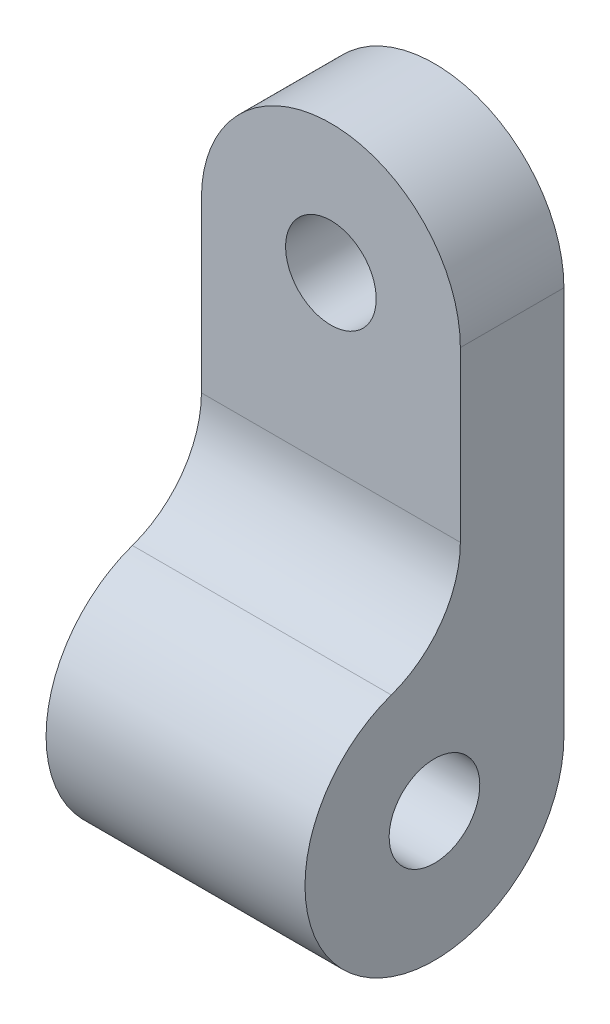
ISO-10303-21;
HEADER;
FILE_DESCRIPTION(('STEP AP214'),'2;1');
FILE_NAME('part.step','',(''),(''),'','','');
FILE_SCHEMA(('AUTOMOTIVE_DESIGN { 1 0 10303 214 1 1 1 1 }'));
ENDSEC;
DATA;
#1=APPLICATION_CONTEXT('core data for automotive mechanical design processes');
#2=APPLICATION_PROTOCOL_DEFINITION('international standard','automotive_design',2000,#1);
#3=PRODUCT_CONTEXT('',#1,'mechanical');
#4=PRODUCT('Part','Part','',(#3));
#5=PRODUCT_RELATED_PRODUCT_CATEGORY('part','',(#4));
#6=PRODUCT_DEFINITION_FORMATION('','',#4);
#7=PRODUCT_DEFINITION_CONTEXT('part definition',#1,'design');
#8=PRODUCT_DEFINITION('design','',#6,#7);
#9=PRODUCT_DEFINITION_SHAPE('','',#8);
#10=(LENGTH_UNIT() NAMED_UNIT(*) SI_UNIT(.MILLI.,.METRE.));
#11=(NAMED_UNIT(*) PLANE_ANGLE_UNIT() SI_UNIT($,.RADIAN.));
#12=(NAMED_UNIT(*) SI_UNIT($,.STERADIAN.) SOLID_ANGLE_UNIT());
#13=UNCERTAINTY_MEASURE_WITH_UNIT(LENGTH_MEASURE(1.E-05),#10,'distance_accuracy_value','');
#14=(GEOMETRIC_REPRESENTATION_CONTEXT(3) GLOBAL_UNCERTAINTY_ASSIGNED_CONTEXT((#13)) GLOBAL_UNIT_ASSIGNED_CONTEXT((#10,
#11,#12)) REPRESENTATION_CONTEXT('',''));
#15=CARTESIAN_POINT('',(0.,0.,0.));
#16=DIRECTION('',(0.,0.,1.));
#17=DIRECTION('',(1.,0.,0.));
#18=AXIS2_PLACEMENT_3D('',#15,#16,#17);
#19=CARTESIAN_POINT('',(-5.,0.,10.));
#20=DIRECTION('',(1.,0.,0.));
#21=DIRECTION('',(0.,1.,0.));
#22=AXIS2_PLACEMENT_3D('',#19,#20,#21);
#23=PLANE('',#22);
#24=CARTESIAN_POINT('',(-5.,-15.,5.));
#25=DIRECTION('',(-1.,0.,0.));
#26=DIRECTION('',(0.,-1.,0.));
#27=AXIS2_PLACEMENT_3D('',#24,#25,#26);
#28=CIRCLE('',#27,1.75);
#29=CARTESIAN_POINT('',(-5.,-16.75,5.));
#30=VERTEX_POINT('',#29);
#31=EDGE_CURVE('E233',#30,#30,#28,.T.);
#32=ORIENTED_EDGE('',*,*,#31,.F.);
#33=EDGE_LOOP('',(#32));
#34=FACE_BOUND('',#33,.T.);
#35=DIRECTION('',(0.,-1.,0.));
#36=VECTOR('',#35,1.);
#37=CARTESIAN_POINT('',(-5.,0.,0.));
#38=LINE('',#37,#36);
#39=CARTESIAN_POINT('',(-5.,0.,0.));
#40=VERTEX_POINT('',#39);
#41=CARTESIAN_POINT('',(-5.,-15.,0.));
#42=VERTEX_POINT('',#41);
#43=EDGE_CURVE('E212',#40,#42,#38,.T.);
#44=ORIENTED_EDGE('',*,*,#43,.T.);
#45=CARTESIAN_POINT('',(-5.,-15.,5.));
#46=DIRECTION('',(-1.,0.,0.));
#47=DIRECTION('',(0.,-1.,0.));
#48=AXIS2_PLACEMENT_3D('',#45,#46,#47);
#49=CIRCLE('',#48,5.);
#50=CARTESIAN_POINT('',(-5.,-10.2859547920897,6.66666666666667));
#51=VERTEX_POINT('',#50);
#52=EDGE_CURVE('E200',#42,#51,#49,.T.);
#53=ORIENTED_EDGE('',*,*,#52,.T.);
#54=CARTESIAN_POINT('',(-5.,-6.51471862576143,8.));
#55=DIRECTION('',(-1.,0.,0.));
#56=DIRECTION('',(0.,-1.,0.));
#57=AXIS2_PLACEMENT_3D('',#54,#55,#56);
#58=CIRCLE('',#57,4.);
#59=CARTESIAN_POINT('',(-5.,-6.51471862576143,4.));
#60=VERTEX_POINT('',#59);
#61=EDGE_CURVE('E228',#60,#51,#58,.T.);
#62=ORIENTED_EDGE('',*,*,#61,.F.);
#63=DIRECTION('',(0.,-1.,0.));
#64=VECTOR('',#63,1.);
#65=CARTESIAN_POINT('',(-5.,0.,4.));
#66=LINE('',#65,#64);
#67=CARTESIAN_POINT('',(-5.,0.,4.));
#68=VERTEX_POINT('',#67);
#69=EDGE_CURVE('E204',#68,#60,#66,.T.);
#70=ORIENTED_EDGE('',*,*,#69,.F.);
#71=DIRECTION('',(0.,0.,-1.));
#72=VECTOR('',#71,1.);
#73=CARTESIAN_POINT('',(-5.,0.,10.));
#74=LINE('',#73,#72);
#75=EDGE_CURVE('E12',#68,#40,#74,.T.);
#76=ORIENTED_EDGE('',*,*,#75,.T.);
#77=EDGE_LOOP('',(#44,#53,#62,#70,#76));
#78=FACE_BOUND('',#77,.T.);
#79=ADVANCED_FACE('F141',(#34,#78),#23,.F.);
#80=CARTESIAN_POINT('',(5.,-20.,10.));
#81=DIRECTION('',(-1.,0.,0.));
#82=DIRECTION('',(0.,-1.,0.));
#83=AXIS2_PLACEMENT_3D('',#80,#81,#82);
#84=PLANE('',#83);
#85=CARTESIAN_POINT('',(5.,-15.,5.));
#86=DIRECTION('',(-1.,0.,0.));
#87=DIRECTION('',(0.,-1.,0.));
#88=AXIS2_PLACEMENT_3D('',#85,#86,#87);
#89=CIRCLE('',#88,1.75);
#90=CARTESIAN_POINT('',(5.,-16.75,5.));
#91=VERTEX_POINT('',#90);
#92=EDGE_CURVE('E205',#91,#91,#89,.T.);
#93=ORIENTED_EDGE('',*,*,#92,.T.);
#94=EDGE_LOOP('',(#93));
#95=FACE_BOUND('',#94,.T.);
#96=CARTESIAN_POINT('',(5.,-15.,5.));
#97=DIRECTION('',(-1.,0.,0.));
#98=DIRECTION('',(0.,-1.,0.));
#99=AXIS2_PLACEMENT_3D('',#96,#97,#98);
#100=CIRCLE('',#99,5.);
#101=CARTESIAN_POINT('',(5.,-15.,0.));
#102=VERTEX_POINT('',#101);
#103=CARTESIAN_POINT('',(5.,-10.2859547920897,6.66666666666667));
#104=VERTEX_POINT('',#103);
#105=EDGE_CURVE('E188',#102,#104,#100,.T.);
#106=ORIENTED_EDGE('',*,*,#105,.F.);
#107=DIRECTION('',(0.,1.,0.));
#108=VECTOR('',#107,1.);
#109=CARTESIAN_POINT('',(5.,-20.,0.));
#110=LINE('',#109,#108);
#111=CARTESIAN_POINT('',(5.,0.,0.));
#112=VERTEX_POINT('',#111);
#113=EDGE_CURVE('E165',#102,#112,#110,.T.);
#114=ORIENTED_EDGE('',*,*,#113,.T.);
#115=DIRECTION('',(0.,0.,-1.));
#116=VECTOR('',#115,1.);
#117=CARTESIAN_POINT('',(5.,0.,10.));
#118=LINE('',#117,#116);
#119=CARTESIAN_POINT('',(5.,0.,4.));
#120=VERTEX_POINT('',#119);
#121=EDGE_CURVE('E150',#120,#112,#118,.T.);
#122=ORIENTED_EDGE('',*,*,#121,.F.);
#123=DIRECTION('',(0.,-1.,0.));
#124=VECTOR('',#123,1.);
#125=CARTESIAN_POINT('',(5.,0.,4.));
#126=LINE('',#125,#124);
#127=CARTESIAN_POINT('',(5.,-6.51471862576143,4.));
#128=VERTEX_POINT('',#127);
#129=EDGE_CURVE('E227',#120,#128,#126,.T.);
#130=ORIENTED_EDGE('',*,*,#129,.T.);
#131=CARTESIAN_POINT('',(5.,-6.51471862576143,8.));
#132=DIRECTION('',(-1.,0.,0.));
#133=DIRECTION('',(0.,-1.,0.));
#134=AXIS2_PLACEMENT_3D('',#131,#132,#133);
#135=CIRCLE('',#134,4.);
#136=EDGE_CURVE('E192',#128,#104,#135,.T.);
#137=ORIENTED_EDGE('',*,*,#136,.T.);
#138=EDGE_LOOP('',(#106,#114,#122,#130,#137));
#139=FACE_BOUND('',#138,.T.);
#140=ADVANCED_FACE('F190',(#95,#139),#84,.F.);
#141=CARTESIAN_POINT('',(0.,0.,0.));
#142=DIRECTION('',(0.,0.,1.));
#143=DIRECTION('',(1.,0.,0.));
#144=AXIS2_PLACEMENT_3D('',#141,#142,#143);
#145=PLANE('',#144);
#146=ORIENTED_EDGE('',*,*,#113,.F.);
#147=DIRECTION('',(-1.,0.,0.));
#148=VECTOR('',#147,1.);
#149=CARTESIAN_POINT('',(5.,-15.,0.));
#150=LINE('',#149,#148);
#151=EDGE_CURVE('E197',#102,#42,#150,.T.);
#152=ORIENTED_EDGE('',*,*,#151,.T.);
#153=ORIENTED_EDGE('',*,*,#43,.F.);
#154=CARTESIAN_POINT('',(0.,0.,0.));
#155=DIRECTION('',(0.,0.,1.));
#156=DIRECTION('',(1.,0.,0.));
#157=AXIS2_PLACEMENT_3D('',#154,#155,#156);
#158=CIRCLE('',#157,5.);
#159=EDGE_CURVE('E211',#112,#40,#158,.T.);
#160=ORIENTED_EDGE('',*,*,#159,.F.);
#161=EDGE_LOOP('',(#146,#152,#153,#160));
#162=FACE_BOUND('',#161,.T.);
#163=CARTESIAN_POINT('',(0.,0.,0.));
#164=DIRECTION('',(0.,0.,1.));
#165=DIRECTION('',(1.,0.,0.));
#166=AXIS2_PLACEMENT_3D('',#163,#164,#165);
#167=CIRCLE('',#166,1.75);
#168=CARTESIAN_POINT('',(1.75,0.,0.));
#169=VERTEX_POINT('',#168);
#170=EDGE_CURVE('E218',#169,#169,#167,.T.);
#171=ORIENTED_EDGE('',*,*,#170,.T.);
#172=EDGE_LOOP('',(#171));
#173=FACE_BOUND('',#172,.T.);
#174=ADVANCED_FACE('F208',(#162,#173),#145,.F.);
#175=CARTESIAN_POINT('',(0.,0.,10.));
#176=DIRECTION('',(0.,0.,-1.));
#177=DIRECTION('',(-1.,0.,0.));
#178=AXIS2_PLACEMENT_3D('',#175,#176,#177);
#179=CYLINDRICAL_SURFACE('',#178,5.);
#180=CARTESIAN_POINT('',(0.,0.,4.));
#181=DIRECTION('',(0.,0.,-1.));
#182=DIRECTION('',(0.,1.,0.));
#183=AXIS2_PLACEMENT_3D('',#180,#181,#182);
#184=CIRCLE('',#183,5.);
#185=EDGE_CURVE('E221',#68,#120,#184,.T.);
#186=ORIENTED_EDGE('',*,*,#185,.T.);
#187=ORIENTED_EDGE('',*,*,#121,.T.);
#188=ORIENTED_EDGE('',*,*,#159,.T.);
#189=ORIENTED_EDGE('',*,*,#75,.F.);
#190=EDGE_LOOP('',(#186,#187,#188,#189));
#191=FACE_BOUND('',#190,.T.);
#192=ADVANCED_FACE('F143',(#191),#179,.T.);
#193=CARTESIAN_POINT('',(0.,0.,10.));
#194=DIRECTION('',(0.,0.,-1.));
#195=DIRECTION('',(-1.,0.,0.));
#196=AXIS2_PLACEMENT_3D('',#193,#194,#195);
#197=CYLINDRICAL_SURFACE('',#196,1.75);
#198=CARTESIAN_POINT('',(0.,0.,4.));
#199=DIRECTION('',(0.,0.,-1.));
#200=DIRECTION('',(0.,1.,0.));
#201=AXIS2_PLACEMENT_3D('',#198,#199,#200);
#202=CIRCLE('',#201,1.75);
#203=CARTESIAN_POINT('',(0.,1.75,4.));
#204=VERTEX_POINT('',#203);
#205=EDGE_CURVE('E145',#204,#204,#202,.T.);
#206=ORIENTED_EDGE('',*,*,#205,.F.);
#207=EDGE_LOOP('',(#206));
#208=FACE_BOUND('',#207,.T.);
#209=ORIENTED_EDGE('',*,*,#170,.F.);
#210=EDGE_LOOP('',(#209));
#211=FACE_BOUND('',#210,.T.);
#212=ADVANCED_FACE('F265',(#208,#211),#197,.F.);
#213=CARTESIAN_POINT('',(5.,0.,4.));
#214=DIRECTION('',(0.,0.,-1.));
#215=DIRECTION('',(0.,1.,0.));
#216=AXIS2_PLACEMENT_3D('',#213,#214,#215);
#217=PLANE('',#216);
#218=ORIENTED_EDGE('',*,*,#205,.T.);
#219=EDGE_LOOP('',(#218));
#220=FACE_BOUND('',#219,.T.);
#221=ORIENTED_EDGE('',*,*,#185,.F.);
#222=ORIENTED_EDGE('',*,*,#69,.T.);
#223=DIRECTION('',(-1.,0.,0.));
#224=VECTOR('',#223,1.);
#225=CARTESIAN_POINT('',(5.,-6.51471862576143,4.));
#226=LINE('',#225,#224);
#227=EDGE_CURVE('E194',#128,#60,#226,.T.);
#228=ORIENTED_EDGE('',*,*,#227,.F.);
#229=ORIENTED_EDGE('',*,*,#129,.F.);
#230=EDGE_LOOP('',(#221,#222,#228,#229));
#231=FACE_BOUND('',#230,.T.);
#232=ADVANCED_FACE('F255',(#220,#231),#217,.F.);
#233=CARTESIAN_POINT('',(5.,-15.,5.));
#234=DIRECTION('',(-1.,0.,0.));
#235=DIRECTION('',(0.,-1.,0.));
#236=AXIS2_PLACEMENT_3D('',#233,#234,#235);
#237=CYLINDRICAL_SURFACE('',#236,5.);
#238=ORIENTED_EDGE('',*,*,#52,.F.);
#239=ORIENTED_EDGE('',*,*,#151,.F.);
#240=ORIENTED_EDGE('',*,*,#105,.T.);
#241=DIRECTION('',(-1.,0.,0.));
#242=VECTOR('',#241,1.);
#243=CARTESIAN_POINT('',(5.,-10.2859547920897,6.66666666666667));
#244=LINE('',#243,#242);
#245=EDGE_CURVE('E157',#104,#51,#244,.T.);
#246=ORIENTED_EDGE('',*,*,#245,.T.);
#247=EDGE_LOOP('',(#238,#239,#240,#246));
#248=FACE_BOUND('',#247,.T.);
#249=ADVANCED_FACE('F198',(#248),#237,.T.);
#250=CARTESIAN_POINT('',(5.,-6.51471862576143,8.));
#251=DIRECTION('',(-1.,0.,0.));
#252=DIRECTION('',(0.,-1.,0.));
#253=AXIS2_PLACEMENT_3D('',#250,#251,#252);
#254=CYLINDRICAL_SURFACE('',#253,4.);
#255=ORIENTED_EDGE('',*,*,#61,.T.);
#256=ORIENTED_EDGE('',*,*,#245,.F.);
#257=ORIENTED_EDGE('',*,*,#136,.F.);
#258=ORIENTED_EDGE('',*,*,#227,.T.);
#259=EDGE_LOOP('',(#255,#256,#257,#258));
#260=FACE_BOUND('',#259,.T.);
#261=ADVANCED_FACE('F243',(#260),#254,.F.);
#262=CARTESIAN_POINT('',(5.,-15.,5.));
#263=DIRECTION('',(-1.,0.,0.));
#264=DIRECTION('',(0.,-1.,0.));
#265=AXIS2_PLACEMENT_3D('',#262,#263,#264);
#266=CYLINDRICAL_SURFACE('',#265,1.75);
#267=ORIENTED_EDGE('',*,*,#92,.F.);
#268=EDGE_LOOP('',(#267));
#269=FACE_BOUND('',#268,.T.);
#270=ORIENTED_EDGE('',*,*,#31,.T.);
#271=EDGE_LOOP('',(#270));
#272=FACE_BOUND('',#271,.T.);
#273=ADVANCED_FACE('F240',(#269,#272),#266,.F.);
#274=CLOSED_SHELL('',(#79,#140,#174,#192,#212,#232,#249,#261,#273));
#275=MANIFOLD_SOLID_BREP('B2',#274);
#276=ADVANCED_BREP_SHAPE_REPRESENTATION('',(#18,#275),#14);
#277=SHAPE_DEFINITION_REPRESENTATION(#9,#276);
ENDSEC;
END-ISO-10303-21;
